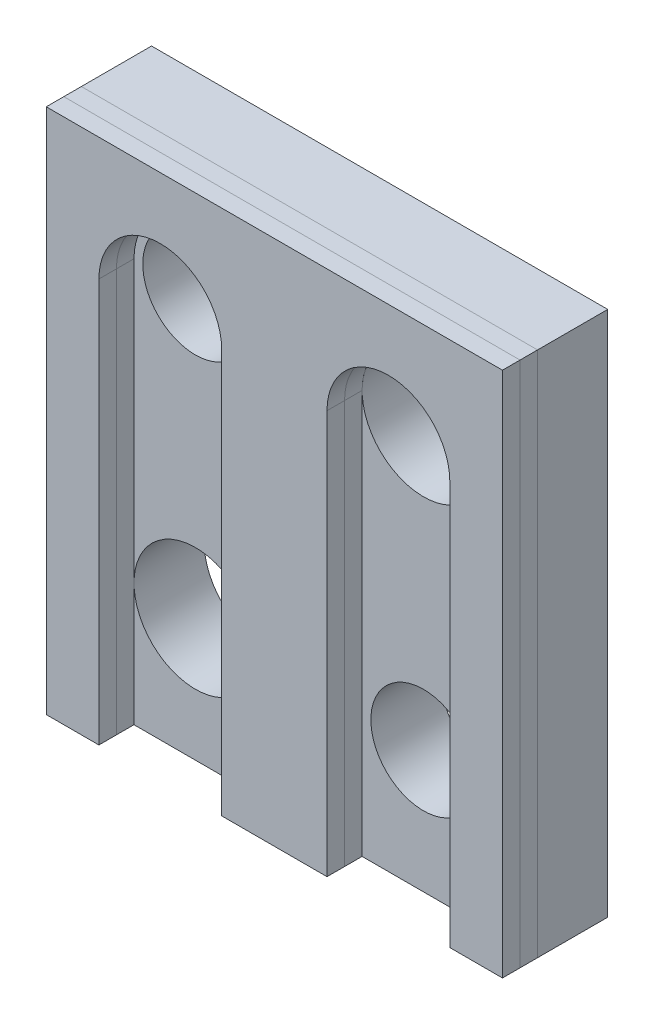
ISO-10303-21;
HEADER;
FILE_DESCRIPTION(('STEP AP214'),'2;1');
FILE_NAME('part.step','',(''),(''),'','','');
FILE_SCHEMA(('AUTOMOTIVE_DESIGN { 1 0 10303 214 1 1 1 1 }'));
ENDSEC;
DATA;
#1=APPLICATION_CONTEXT('core data for automotive mechanical design processes');
#2=APPLICATION_PROTOCOL_DEFINITION('international standard','automotive_design',2000,#1);
#3=PRODUCT_CONTEXT('',#1,'mechanical');
#4=PRODUCT('Part','Part','',(#3));
#5=PRODUCT_RELATED_PRODUCT_CATEGORY('part','',(#4));
#6=PRODUCT_DEFINITION_FORMATION('','',#4);
#7=PRODUCT_DEFINITION_CONTEXT('part definition',#1,'design');
#8=PRODUCT_DEFINITION('design','',#6,#7);
#9=PRODUCT_DEFINITION_SHAPE('','',#8);
#10=(LENGTH_UNIT() NAMED_UNIT(*) SI_UNIT(.MILLI.,.METRE.));
#11=(NAMED_UNIT(*) PLANE_ANGLE_UNIT() SI_UNIT($,.RADIAN.));
#12=(NAMED_UNIT(*) SI_UNIT($,.STERADIAN.) SOLID_ANGLE_UNIT());
#13=UNCERTAINTY_MEASURE_WITH_UNIT(LENGTH_MEASURE(1.E-05),#10,'distance_accuracy_value','');
#14=(GEOMETRIC_REPRESENTATION_CONTEXT(3) GLOBAL_UNCERTAINTY_ASSIGNED_CONTEXT((#13)) GLOBAL_UNIT_ASSIGNED_CONTEXT((#10,
#11,#12)) REPRESENTATION_CONTEXT('',''));
#15=CARTESIAN_POINT('',(0.,0.,0.));
#16=DIRECTION('',(0.,0.,1.));
#17=DIRECTION('',(1.,0.,0.));
#18=AXIS2_PLACEMENT_3D('',#15,#16,#17);
#19=CARTESIAN_POINT('',(-13.,-15.01,5.));
#20=DIRECTION('',(0.,0.,1.));
#21=DIRECTION('',(1.,0.,0.));
#22=AXIS2_PLACEMENT_3D('',#19,#20,#21);
#23=PLANE('',#22);
#24=DIRECTION('',(0.,-1.,0.));
#25=VECTOR('',#24,1.);
#26=CARTESIAN_POINT('',(10.,8.,5.));
#27=LINE('',#26,#25);
#28=CARTESIAN_POINT('',(10.,8.,5.));
#29=VERTEX_POINT('',#28);
#30=CARTESIAN_POINT('',(9.99999999999999,-15.,5.));
#31=VERTEX_POINT('',#30);
#32=EDGE_CURVE('E145',#29,#31,#27,.T.);
#33=ORIENTED_EDGE('',*,*,#32,.T.);
#34=DIRECTION('',(1.,0.,0.));
#35=VECTOR('',#34,1.);
#36=CARTESIAN_POINT('',(9.99999999999999,-15.,5.));
#37=LINE('',#36,#35);
#38=CARTESIAN_POINT('',(13.,-15.,5.));
#39=VERTEX_POINT('',#38);
#40=EDGE_CURVE('E152',#31,#39,#37,.T.);
#41=ORIENTED_EDGE('',*,*,#40,.T.);
#42=DIRECTION('',(0.,1.,0.));
#43=VECTOR('',#42,1.);
#44=CARTESIAN_POINT('',(13.,-15.,5.));
#45=LINE('',#44,#43);
#46=CARTESIAN_POINT('',(13.,15.,5.));
#47=VERTEX_POINT('',#46);
#48=EDGE_CURVE('E156',#39,#47,#45,.T.);
#49=ORIENTED_EDGE('',*,*,#48,.T.);
#50=DIRECTION('',(-1.,0.,0.));
#51=VECTOR('',#50,1.);
#52=CARTESIAN_POINT('',(13.,15.,5.));
#53=LINE('',#52,#51);
#54=CARTESIAN_POINT('',(-13.,15.,5.));
#55=VERTEX_POINT('',#54);
#56=EDGE_CURVE('E220',#47,#55,#53,.T.);
#57=ORIENTED_EDGE('',*,*,#56,.T.);
#58=DIRECTION('',(0.,-1.,0.));
#59=VECTOR('',#58,1.);
#60=CARTESIAN_POINT('',(-13.,15.,5.));
#61=LINE('',#60,#59);
#62=CARTESIAN_POINT('',(-13.,-15.,5.));
#63=VERTEX_POINT('',#62);
#64=EDGE_CURVE('E223',#55,#63,#61,.T.);
#65=ORIENTED_EDGE('',*,*,#64,.T.);
#66=DIRECTION('',(1.,0.,0.));
#67=VECTOR('',#66,1.);
#68=CARTESIAN_POINT('',(-13.,-15.,5.));
#69=LINE('',#68,#67);
#70=CARTESIAN_POINT('',(-9.99999999999999,-15.,5.));
#71=VERTEX_POINT('',#70);
#72=EDGE_CURVE('E226',#63,#71,#69,.T.);
#73=ORIENTED_EDGE('',*,*,#72,.T.);
#74=DIRECTION('',(0.,1.,0.));
#75=VECTOR('',#74,1.);
#76=CARTESIAN_POINT('',(-9.99999999999999,8.,5.));
#77=LINE('',#76,#75);
#78=CARTESIAN_POINT('',(-9.99999999999999,8.,5.));
#79=VERTEX_POINT('',#78);
#80=EDGE_CURVE('E229',#71,#79,#77,.T.);
#81=ORIENTED_EDGE('',*,*,#80,.T.);
#82=CARTESIAN_POINT('',(-6.5,8.,5.));
#83=DIRECTION('',(0.,0.,1.));
#84=DIRECTION('',(1.,0.,0.));
#85=AXIS2_PLACEMENT_3D('',#82,#83,#84);
#86=CIRCLE('',#85,3.5);
#87=CARTESIAN_POINT('',(-3.,8.,5.));
#88=VERTEX_POINT('',#87);
#89=EDGE_CURVE('E232',#79,#88,#86,.F.);
#90=ORIENTED_EDGE('',*,*,#89,.T.);
#91=DIRECTION('',(0.,-1.,0.));
#92=VECTOR('',#91,1.);
#93=CARTESIAN_POINT('',(-3.,8.,5.));
#94=LINE('',#93,#92);
#95=CARTESIAN_POINT('',(-3.,-15.,5.));
#96=VERTEX_POINT('',#95);
#97=EDGE_CURVE('E235',#88,#96,#94,.T.);
#98=ORIENTED_EDGE('',*,*,#97,.T.);
#99=DIRECTION('',(1.,0.,0.));
#100=VECTOR('',#99,1.);
#101=CARTESIAN_POINT('',(-3.,-15.,5.));
#102=LINE('',#101,#100);
#103=CARTESIAN_POINT('',(2.99999999999999,-15.,5.));
#104=VERTEX_POINT('',#103);
#105=EDGE_CURVE('E238',#96,#104,#102,.T.);
#106=ORIENTED_EDGE('',*,*,#105,.T.);
#107=DIRECTION('',(0.,1.,0.));
#108=VECTOR('',#107,1.);
#109=CARTESIAN_POINT('',(3.,8.,5.));
#110=LINE('',#109,#108);
#111=CARTESIAN_POINT('',(3.,8.,5.));
#112=VERTEX_POINT('',#111);
#113=EDGE_CURVE('E163',#104,#112,#110,.T.);
#114=ORIENTED_EDGE('',*,*,#113,.T.);
#115=CARTESIAN_POINT('',(6.5,8.,5.));
#116=DIRECTION('',(0.,0.,1.));
#117=DIRECTION('',(1.,0.,0.));
#118=AXIS2_PLACEMENT_3D('',#115,#116,#117);
#119=CIRCLE('',#118,3.5);
#120=EDGE_CURVE('E161',#112,#29,#119,.F.);
#121=ORIENTED_EDGE('',*,*,#120,.T.);
#122=EDGE_LOOP('',(#33,#41,#49,#57,#65,#73,#81,#90,#98,#106,#114,#121));
#123=FACE_BOUND('',#122,.T.);
#124=ADVANCED_FACE('F51',(#123),#23,.T.);
#125=CARTESIAN_POINT('',(9.99999999999999,-15.,6.));
#126=DIRECTION('',(0.,1.,0.));
#127=DIRECTION('',(-1.,0.,0.));
#128=AXIS2_PLACEMENT_3D('',#125,#126,#127);
#129=PLANE('',#128);
#130=ORIENTED_EDGE('',*,*,#40,.F.);
#131=DIRECTION('',(0.,0.,-1.));
#132=VECTOR('',#131,1.);
#133=CARTESIAN_POINT('',(9.99999999999999,-15.,6.));
#134=LINE('',#133,#132);
#135=CARTESIAN_POINT('',(9.99999999999999,-15.,4.));
#136=VERTEX_POINT('',#135);
#137=EDGE_CURVE('E55',#31,#136,#134,.T.);
#138=ORIENTED_EDGE('',*,*,#137,.T.);
#139=DIRECTION('',(1.,0.,0.));
#140=VECTOR('',#139,1.);
#141=CARTESIAN_POINT('',(9.99999999999999,-15.,4.));
#142=LINE('',#141,#140);
#143=CARTESIAN_POINT('',(13.,-15.,4.));
#144=VERTEX_POINT('',#143);
#145=EDGE_CURVE('E12',#136,#144,#142,.T.);
#146=ORIENTED_EDGE('',*,*,#145,.T.);
#147=DIRECTION('',(0.,0.,-1.));
#148=VECTOR('',#147,1.);
#149=CARTESIAN_POINT('',(13.,-15.,6.));
#150=LINE('',#149,#148);
#151=EDGE_CURVE('E68',#39,#144,#150,.T.);
#152=ORIENTED_EDGE('',*,*,#151,.F.);
#153=EDGE_LOOP('',(#130,#138,#146,#152));
#154=FACE_BOUND('',#153,.T.);
#155=ADVANCED_FACE('F153',(#154),#129,.F.);
#156=CARTESIAN_POINT('',(13.,-15.,6.));
#157=DIRECTION('',(-1.,0.,0.));
#158=DIRECTION('',(0.,0.,1.));
#159=AXIS2_PLACEMENT_3D('',#156,#157,#158);
#160=PLANE('',#159);
#161=ORIENTED_EDGE('',*,*,#48,.F.);
#162=ORIENTED_EDGE('',*,*,#151,.T.);
#163=DIRECTION('',(0.,1.,0.));
#164=VECTOR('',#163,1.);
#165=CARTESIAN_POINT('',(13.,-15.,4.));
#166=LINE('',#165,#164);
#167=CARTESIAN_POINT('',(13.,15.,4.));
#168=VERTEX_POINT('',#167);
#169=EDGE_CURVE('E60',#144,#168,#166,.T.);
#170=ORIENTED_EDGE('',*,*,#169,.T.);
#171=DIRECTION('',(0.,0.,-1.));
#172=VECTOR('',#171,1.);
#173=CARTESIAN_POINT('',(13.,15.,6.));
#174=LINE('',#173,#172);
#175=EDGE_CURVE('E76',#47,#168,#174,.T.);
#176=ORIENTED_EDGE('',*,*,#175,.F.);
#177=EDGE_LOOP('',(#161,#162,#170,#176));
#178=FACE_BOUND('',#177,.T.);
#179=ADVANCED_FACE('F269',(#178),#160,.F.);
#180=CARTESIAN_POINT('',(13.,15.,6.));
#181=DIRECTION('',(0.,-1.,0.));
#182=DIRECTION('',(0.,0.,-1.));
#183=AXIS2_PLACEMENT_3D('',#180,#181,#182);
#184=PLANE('',#183);
#185=ORIENTED_EDGE('',*,*,#56,.F.);
#186=ORIENTED_EDGE('',*,*,#175,.T.);
#187=DIRECTION('',(-1.,0.,0.));
#188=VECTOR('',#187,1.);
#189=CARTESIAN_POINT('',(13.,15.,4.));
#190=LINE('',#189,#188);
#191=CARTESIAN_POINT('',(-13.,15.,4.));
#192=VERTEX_POINT('',#191);
#193=EDGE_CURVE('E216',#168,#192,#190,.T.);
#194=ORIENTED_EDGE('',*,*,#193,.T.);
#195=DIRECTION('',(0.,0.,-1.));
#196=VECTOR('',#195,1.);
#197=CARTESIAN_POINT('',(-13.,15.,6.));
#198=LINE('',#197,#196);
#199=EDGE_CURVE('E169',#55,#192,#198,.T.);
#200=ORIENTED_EDGE('',*,*,#199,.F.);
#201=EDGE_LOOP('',(#185,#186,#194,#200));
#202=FACE_BOUND('',#201,.T.);
#203=ADVANCED_FACE('F268',(#202),#184,.F.);
#204=CARTESIAN_POINT('',(-13.,15.,6.));
#205=DIRECTION('',(1.,0.,0.));
#206=DIRECTION('',(0.,0.,-1.));
#207=AXIS2_PLACEMENT_3D('',#204,#205,#206);
#208=PLANE('',#207);
#209=ORIENTED_EDGE('',*,*,#64,.F.);
#210=ORIENTED_EDGE('',*,*,#199,.T.);
#211=DIRECTION('',(0.,-1.,0.));
#212=VECTOR('',#211,1.);
#213=CARTESIAN_POINT('',(-13.,15.,4.));
#214=LINE('',#213,#212);
#215=CARTESIAN_POINT('',(-13.,-15.,4.));
#216=VERTEX_POINT('',#215);
#217=EDGE_CURVE('E213',#192,#216,#214,.T.);
#218=ORIENTED_EDGE('',*,*,#217,.T.);
#219=DIRECTION('',(0.,0.,-1.));
#220=VECTOR('',#219,1.);
#221=CARTESIAN_POINT('',(-13.,-15.,6.));
#222=LINE('',#221,#220);
#223=EDGE_CURVE('E171',#63,#216,#222,.T.);
#224=ORIENTED_EDGE('',*,*,#223,.F.);
#225=EDGE_LOOP('',(#209,#210,#218,#224));
#226=FACE_BOUND('',#225,.T.);
#227=ADVANCED_FACE('F266',(#226),#208,.F.);
#228=CARTESIAN_POINT('',(-13.,-15.,6.));
#229=DIRECTION('',(0.,1.,0.));
#230=DIRECTION('',(-1.,0.,0.));
#231=AXIS2_PLACEMENT_3D('',#228,#229,#230);
#232=PLANE('',#231);
#233=ORIENTED_EDGE('',*,*,#72,.F.);
#234=ORIENTED_EDGE('',*,*,#223,.T.);
#235=DIRECTION('',(1.,0.,0.));
#236=VECTOR('',#235,1.);
#237=CARTESIAN_POINT('',(-13.,-15.,4.));
#238=LINE('',#237,#236);
#239=CARTESIAN_POINT('',(-9.99999999999999,-15.,4.));
#240=VERTEX_POINT('',#239);
#241=EDGE_CURVE('E210',#216,#240,#238,.T.);
#242=ORIENTED_EDGE('',*,*,#241,.T.);
#243=DIRECTION('',(0.,0.,-1.));
#244=VECTOR('',#243,1.);
#245=CARTESIAN_POINT('',(-9.99999999999999,-15.,6.));
#246=LINE('',#245,#244);
#247=EDGE_CURVE('E173',#71,#240,#246,.T.);
#248=ORIENTED_EDGE('',*,*,#247,.F.);
#249=EDGE_LOOP('',(#233,#234,#242,#248));
#250=FACE_BOUND('',#249,.T.);
#251=ADVANCED_FACE('F263',(#250),#232,.F.);
#252=CARTESIAN_POINT('',(-9.99999999999999,8.,6.));
#253=DIRECTION('',(-1.,0.,0.));
#254=DIRECTION('',(0.,0.,1.));
#255=AXIS2_PLACEMENT_3D('',#252,#253,#254);
#256=PLANE('',#255);
#257=ORIENTED_EDGE('',*,*,#80,.F.);
#258=ORIENTED_EDGE('',*,*,#247,.T.);
#259=DIRECTION('',(0.,1.,0.));
#260=VECTOR('',#259,1.);
#261=CARTESIAN_POINT('',(-9.99999999999999,8.,4.));
#262=LINE('',#261,#260);
#263=CARTESIAN_POINT('',(-9.99999999999999,8.,4.));
#264=VERTEX_POINT('',#263);
#265=EDGE_CURVE('E207',#240,#264,#262,.T.);
#266=ORIENTED_EDGE('',*,*,#265,.T.);
#267=DIRECTION('',(0.,0.,-1.));
#268=VECTOR('',#267,1.);
#269=CARTESIAN_POINT('',(-9.99999999999999,8.,6.));
#270=LINE('',#269,#268);
#271=EDGE_CURVE('E175',#79,#264,#270,.T.);
#272=ORIENTED_EDGE('',*,*,#271,.F.);
#273=EDGE_LOOP('',(#257,#258,#266,#272));
#274=FACE_BOUND('',#273,.T.);
#275=ADVANCED_FACE('F260',(#274),#256,.F.);
#276=CARTESIAN_POINT('',(-6.5,8.,6.));
#277=DIRECTION('',(0.,0.,-1.));
#278=DIRECTION('',(-1.,0.,0.));
#279=AXIS2_PLACEMENT_3D('',#276,#277,#278);
#280=CYLINDRICAL_SURFACE('',#279,3.5);
#281=ORIENTED_EDGE('',*,*,#89,.F.);
#282=ORIENTED_EDGE('',*,*,#271,.T.);
#283=CARTESIAN_POINT('',(-6.5,8.,4.));
#284=DIRECTION('',(0.,0.,-1.));
#285=DIRECTION('',(1.,0.,0.));
#286=AXIS2_PLACEMENT_3D('',#283,#284,#285);
#287=CIRCLE('',#286,3.5);
#288=CARTESIAN_POINT('',(-3.,8.,4.));
#289=VERTEX_POINT('',#288);
#290=EDGE_CURVE('E204',#264,#289,#287,.T.);
#291=ORIENTED_EDGE('',*,*,#290,.T.);
#292=DIRECTION('',(0.,0.,-1.));
#293=VECTOR('',#292,1.);
#294=CARTESIAN_POINT('',(-3.,8.,6.));
#295=LINE('',#294,#293);
#296=EDGE_CURVE('E177',#88,#289,#295,.T.);
#297=ORIENTED_EDGE('',*,*,#296,.F.);
#298=EDGE_LOOP('',(#281,#282,#291,#297));
#299=FACE_BOUND('',#298,.T.);
#300=ADVANCED_FACE('F254',(#299),#280,.F.);
#301=CARTESIAN_POINT('',(-3.,8.,6.));
#302=DIRECTION('',(1.,0.,0.));
#303=DIRECTION('',(0.,1.,0.));
#304=AXIS2_PLACEMENT_3D('',#301,#302,#303);
#305=PLANE('',#304);
#306=ORIENTED_EDGE('',*,*,#97,.F.);
#307=ORIENTED_EDGE('',*,*,#296,.T.);
#308=DIRECTION('',(0.,-1.,0.));
#309=VECTOR('',#308,1.);
#310=CARTESIAN_POINT('',(-3.,8.,4.));
#311=LINE('',#310,#309);
#312=CARTESIAN_POINT('',(-3.,-15.,4.));
#313=VERTEX_POINT('',#312);
#314=EDGE_CURVE('E201',#289,#313,#311,.T.);
#315=ORIENTED_EDGE('',*,*,#314,.T.);
#316=DIRECTION('',(0.,0.,-1.));
#317=VECTOR('',#316,1.);
#318=CARTESIAN_POINT('',(-3.,-15.,6.));
#319=LINE('',#318,#317);
#320=EDGE_CURVE('E179',#96,#313,#319,.T.);
#321=ORIENTED_EDGE('',*,*,#320,.F.);
#322=EDGE_LOOP('',(#306,#307,#315,#321));
#323=FACE_BOUND('',#322,.T.);
#324=ADVANCED_FACE('F251',(#323),#305,.F.);
#325=CARTESIAN_POINT('',(-3.,-15.,6.));
#326=DIRECTION('',(0.,1.,0.));
#327=DIRECTION('',(0.,0.,1.));
#328=AXIS2_PLACEMENT_3D('',#325,#326,#327);
#329=PLANE('',#328);
#330=ORIENTED_EDGE('',*,*,#105,.F.);
#331=ORIENTED_EDGE('',*,*,#320,.T.);
#332=DIRECTION('',(1.,0.,0.));
#333=VECTOR('',#332,1.);
#334=CARTESIAN_POINT('',(-3.,-15.,4.));
#335=LINE('',#334,#333);
#336=CARTESIAN_POINT('',(2.99999999999999,-15.,4.));
#337=VERTEX_POINT('',#336);
#338=EDGE_CURVE('E198',#313,#337,#335,.T.);
#339=ORIENTED_EDGE('',*,*,#338,.T.);
#340=DIRECTION('',(0.,0.,-1.));
#341=VECTOR('',#340,1.);
#342=CARTESIAN_POINT('',(2.99999999999999,-15.,6.));
#343=LINE('',#342,#341);
#344=EDGE_CURVE('E181',#104,#337,#343,.T.);
#345=ORIENTED_EDGE('',*,*,#344,.F.);
#346=EDGE_LOOP('',(#330,#331,#339,#345));
#347=FACE_BOUND('',#346,.T.);
#348=ADVANCED_FACE('F248',(#347),#329,.F.);
#349=CARTESIAN_POINT('',(3.,8.,6.));
#350=DIRECTION('',(-1.,0.,0.));
#351=DIRECTION('',(0.,-1.,0.));
#352=AXIS2_PLACEMENT_3D('',#349,#350,#351);
#353=PLANE('',#352);
#354=ORIENTED_EDGE('',*,*,#113,.F.);
#355=ORIENTED_EDGE('',*,*,#344,.T.);
#356=DIRECTION('',(0.,1.,0.));
#357=VECTOR('',#356,1.);
#358=CARTESIAN_POINT('',(3.,8.,4.));
#359=LINE('',#358,#357);
#360=CARTESIAN_POINT('',(3.,8.,4.));
#361=VERTEX_POINT('',#360);
#362=EDGE_CURVE('E192',#337,#361,#359,.T.);
#363=ORIENTED_EDGE('',*,*,#362,.T.);
#364=DIRECTION('',(0.,0.,-1.));
#365=VECTOR('',#364,1.);
#366=CARTESIAN_POINT('',(3.,8.,6.));
#367=LINE('',#366,#365);
#368=EDGE_CURVE('E183',#112,#361,#367,.T.);
#369=ORIENTED_EDGE('',*,*,#368,.F.);
#370=EDGE_LOOP('',(#354,#355,#363,#369));
#371=FACE_BOUND('',#370,.T.);
#372=ADVANCED_FACE('F243',(#371),#353,.F.);
#373=CARTESIAN_POINT('',(6.5,8.,6.));
#374=DIRECTION('',(0.,0.,-1.));
#375=DIRECTION('',(-1.,0.,0.));
#376=AXIS2_PLACEMENT_3D('',#373,#374,#375);
#377=CYLINDRICAL_SURFACE('',#376,3.5);
#378=ORIENTED_EDGE('',*,*,#120,.F.);
#379=ORIENTED_EDGE('',*,*,#368,.T.);
#380=CARTESIAN_POINT('',(6.5,8.,4.));
#381=DIRECTION('',(0.,0.,-1.));
#382=DIRECTION('',(1.,0.,0.));
#383=AXIS2_PLACEMENT_3D('',#380,#381,#382);
#384=CIRCLE('',#383,3.5);
#385=CARTESIAN_POINT('',(10.,8.,4.));
#386=VERTEX_POINT('',#385);
#387=EDGE_CURVE('E187',#361,#386,#384,.T.);
#388=ORIENTED_EDGE('',*,*,#387,.T.);
#389=DIRECTION('',(0.,0.,-1.));
#390=VECTOR('',#389,1.);
#391=CARTESIAN_POINT('',(10.,8.,6.));
#392=LINE('',#391,#390);
#393=EDGE_CURVE('E150',#29,#386,#392,.T.);
#394=ORIENTED_EDGE('',*,*,#393,.F.);
#395=EDGE_LOOP('',(#378,#379,#388,#394));
#396=FACE_BOUND('',#395,.T.);
#397=ADVANCED_FACE('F188',(#396),#377,.F.);
#398=CARTESIAN_POINT('',(10.,8.,6.));
#399=DIRECTION('',(1.,0.,0.));
#400=DIRECTION('',(0.,1.,0.));
#401=AXIS2_PLACEMENT_3D('',#398,#399,#400);
#402=PLANE('',#401);
#403=ORIENTED_EDGE('',*,*,#32,.F.);
#404=ORIENTED_EDGE('',*,*,#393,.T.);
#405=DIRECTION('',(0.,-1.,0.));
#406=VECTOR('',#405,1.);
#407=CARTESIAN_POINT('',(10.,8.,4.));
#408=LINE('',#407,#406);
#409=EDGE_CURVE('E147',#386,#136,#408,.T.);
#410=ORIENTED_EDGE('',*,*,#409,.T.);
#411=ORIENTED_EDGE('',*,*,#137,.F.);
#412=EDGE_LOOP('',(#403,#404,#410,#411));
#413=FACE_BOUND('',#412,.T.);
#414=ADVANCED_FACE('F53',(#413),#402,.F.);
#415=CARTESIAN_POINT('',(-6.5,8.,4.));
#416=DIRECTION('',(0.,0.,1.));
#417=DIRECTION('',(1.,0.,0.));
#418=AXIS2_PLACEMENT_3D('',#415,#416,#417);
#419=PLANE('',#418);
#420=ORIENTED_EDGE('',*,*,#145,.F.);
#421=ORIENTED_EDGE('',*,*,#409,.F.);
#422=ORIENTED_EDGE('',*,*,#387,.F.);
#423=ORIENTED_EDGE('',*,*,#362,.F.);
#424=ORIENTED_EDGE('',*,*,#338,.F.);
#425=ORIENTED_EDGE('',*,*,#314,.F.);
#426=ORIENTED_EDGE('',*,*,#290,.F.);
#427=ORIENTED_EDGE('',*,*,#265,.F.);
#428=ORIENTED_EDGE('',*,*,#241,.F.);
#429=ORIENTED_EDGE('',*,*,#217,.F.);
#430=ORIENTED_EDGE('',*,*,#193,.F.);
#431=ORIENTED_EDGE('',*,*,#169,.F.);
#432=EDGE_LOOP('',(#420,#421,#422,#423,#424,#425,#426,#427,#428,#429,#430,#431));
#433=FACE_BOUND('',#432,.T.);
#434=ADVANCED_FACE('F194',(#433),#419,.F.);
#435=CLOSED_SHELL('',(#124,#155,#179,#203,#227,#251,#275,#300,#324,#348,#372,#397,#414,#434));
#436=MANIFOLD_SOLID_BREP('B2',#435);
#437=CARTESIAN_POINT('',(-13.,-15.01,5.));
#438=DIRECTION('',(0.,0.,1.));
#439=DIRECTION('',(1.,0.,0.));
#440=AXIS2_PLACEMENT_3D('',#437,#438,#439);
#441=PLANE('',#440);
#442=DIRECTION('',(0.,-1.,0.));
#443=VECTOR('',#442,1.);
#444=CARTESIAN_POINT('',(10.,8.,5.));
#445=LINE('',#444,#443);
#446=CARTESIAN_POINT('',(10.,8.,5.));
#447=VERTEX_POINT('',#446);
#448=CARTESIAN_POINT('',(9.99999999999999,-15.,5.));
#449=VERTEX_POINT('',#448);
#450=EDGE_CURVE('E496',#447,#449,#445,.T.);
#451=ORIENTED_EDGE('',*,*,#450,.F.);
#452=CARTESIAN_POINT('',(6.5,8.,5.));
#453=DIRECTION('',(0.,0.,1.));
#454=DIRECTION('',(1.,0.,0.));
#455=AXIS2_PLACEMENT_3D('',#452,#453,#454);
#456=CIRCLE('',#455,3.5);
#457=CARTESIAN_POINT('',(3.,8.,5.));
#458=VERTEX_POINT('',#457);
#459=EDGE_CURVE('E499',#458,#447,#456,.F.);
#460=ORIENTED_EDGE('',*,*,#459,.F.);
#461=DIRECTION('',(0.,1.,0.));
#462=VECTOR('',#461,1.);
#463=CARTESIAN_POINT('',(3.,8.,5.));
#464=LINE('',#463,#462);
#465=CARTESIAN_POINT('',(2.99999999999999,-15.,5.));
#466=VERTEX_POINT('',#465);
#467=EDGE_CURVE('E512',#466,#458,#464,.T.);
#468=ORIENTED_EDGE('',*,*,#467,.F.);
#469=DIRECTION('',(1.,0.,0.));
#470=VECTOR('',#469,1.);
#471=CARTESIAN_POINT('',(-3.,-15.,5.));
#472=LINE('',#471,#470);
#473=CARTESIAN_POINT('',(-3.,-15.,5.));
#474=VERTEX_POINT('',#473);
#475=EDGE_CURVE('E514',#474,#466,#472,.T.);
#476=ORIENTED_EDGE('',*,*,#475,.F.);
#477=DIRECTION('',(0.,-1.,0.));
#478=VECTOR('',#477,1.);
#479=CARTESIAN_POINT('',(-3.,8.,5.));
#480=LINE('',#479,#478);
#481=CARTESIAN_POINT('',(-3.,8.,5.));
#482=VERTEX_POINT('',#481);
#483=EDGE_CURVE('E516',#482,#474,#480,.T.);
#484=ORIENTED_EDGE('',*,*,#483,.F.);
#485=CARTESIAN_POINT('',(-6.5,8.,5.));
#486=DIRECTION('',(0.,0.,1.));
#487=DIRECTION('',(1.,0.,0.));
#488=AXIS2_PLACEMENT_3D('',#485,#486,#487);
#489=CIRCLE('',#488,3.5);
#490=CARTESIAN_POINT('',(-9.99999999999999,8.,5.));
#491=VERTEX_POINT('',#490);
#492=EDGE_CURVE('E518',#491,#482,#489,.F.);
#493=ORIENTED_EDGE('',*,*,#492,.F.);
#494=DIRECTION('',(0.,1.,0.));
#495=VECTOR('',#494,1.);
#496=CARTESIAN_POINT('',(-9.99999999999999,8.,5.));
#497=LINE('',#496,#495);
#498=CARTESIAN_POINT('',(-9.99999999999999,-15.,5.));
#499=VERTEX_POINT('',#498);
#500=EDGE_CURVE('E520',#499,#491,#497,.T.);
#501=ORIENTED_EDGE('',*,*,#500,.F.);
#502=DIRECTION('',(1.,0.,0.));
#503=VECTOR('',#502,1.);
#504=CARTESIAN_POINT('',(-13.,-15.,5.));
#505=LINE('',#504,#503);
#506=CARTESIAN_POINT('',(-13.,-15.,5.));
#507=VERTEX_POINT('',#506);
#508=EDGE_CURVE('E508',#507,#499,#505,.T.);
#509=ORIENTED_EDGE('',*,*,#508,.F.);
#510=DIRECTION('',(0.,-1.,0.));
#511=VECTOR('',#510,1.);
#512=CARTESIAN_POINT('',(-13.,15.,5.));
#513=LINE('',#512,#511);
#514=CARTESIAN_POINT('',(-13.,15.,5.));
#515=VERTEX_POINT('',#514);
#516=EDGE_CURVE('E505',#515,#507,#513,.T.);
#517=ORIENTED_EDGE('',*,*,#516,.F.);
#518=DIRECTION('',(-1.,0.,0.));
#519=VECTOR('',#518,1.);
#520=CARTESIAN_POINT('',(13.,15.,5.));
#521=LINE('',#520,#519);
#522=CARTESIAN_POINT('',(13.,15.,5.));
#523=VERTEX_POINT('',#522);
#524=EDGE_CURVE('E507',#523,#515,#521,.T.);
#525=ORIENTED_EDGE('',*,*,#524,.F.);
#526=DIRECTION('',(0.,1.,0.));
#527=VECTOR('',#526,1.);
#528=CARTESIAN_POINT('',(13.,-15.,5.));
#529=LINE('',#528,#527);
#530=CARTESIAN_POINT('',(13.,-15.,5.));
#531=VERTEX_POINT('',#530);
#532=EDGE_CURVE('E401',#531,#523,#529,.T.);
#533=ORIENTED_EDGE('',*,*,#532,.F.);
#534=DIRECTION('',(1.,0.,0.));
#535=VECTOR('',#534,1.);
#536=CARTESIAN_POINT('',(9.99999999999999,-15.,5.));
#537=LINE('',#536,#535);
#538=EDGE_CURVE('E49',#449,#531,#537,.T.);
#539=ORIENTED_EDGE('',*,*,#538,.F.);
#540=EDGE_LOOP('',(#451,#460,#468,#476,#484,#493,#501,#509,#517,#525,#533,#539));
#541=FACE_BOUND('',#540,.T.);
#542=ADVANCED_FACE('F394',(#541),#441,.F.);
#543=CARTESIAN_POINT('',(13.,-15.,6.));
#544=DIRECTION('',(-1.,0.,0.));
#545=DIRECTION('',(0.,0.,1.));
#546=AXIS2_PLACEMENT_3D('',#543,#544,#545);
#547=PLANE('',#546);
#548=DIRECTION('',(0.,0.,-1.));
#549=VECTOR('',#548,1.);
#550=CARTESIAN_POINT('',(13.,-15.,6.));
#551=LINE('',#550,#549);
#552=CARTESIAN_POINT('',(13.,-15.,6.));
#553=VERTEX_POINT('',#552);
#554=EDGE_CURVE('E481',#553,#531,#551,.T.);
#555=ORIENTED_EDGE('',*,*,#554,.T.);
#556=ORIENTED_EDGE('',*,*,#532,.T.);
#557=DIRECTION('',(0.,0.,-1.));
#558=VECTOR('',#557,1.);
#559=CARTESIAN_POINT('',(13.,15.,6.));
#560=LINE('',#559,#558);
#561=CARTESIAN_POINT('',(13.,15.,6.));
#562=VERTEX_POINT('',#561);
#563=EDGE_CURVE('E483',#562,#523,#560,.T.);
#564=ORIENTED_EDGE('',*,*,#563,.F.);
#565=DIRECTION('',(0.,1.,0.));
#566=VECTOR('',#565,1.);
#567=CARTESIAN_POINT('',(13.,-15.,6.));
#568=LINE('',#567,#566);
#569=EDGE_CURVE('E478',#553,#562,#568,.T.);
#570=ORIENTED_EDGE('',*,*,#569,.F.);
#571=EDGE_LOOP('',(#555,#556,#564,#570));
#572=FACE_BOUND('',#571,.T.);
#573=ADVANCED_FACE('F480',(#572),#547,.F.);
#574=CARTESIAN_POINT('',(13.,15.,6.));
#575=DIRECTION('',(0.,-1.,0.));
#576=DIRECTION('',(0.,0.,-1.));
#577=AXIS2_PLACEMENT_3D('',#574,#575,#576);
#578=PLANE('',#577);
#579=ORIENTED_EDGE('',*,*,#563,.T.);
#580=ORIENTED_EDGE('',*,*,#524,.T.);
#581=DIRECTION('',(0.,0.,-1.));
#582=VECTOR('',#581,1.);
#583=CARTESIAN_POINT('',(-13.,15.,6.));
#584=LINE('',#583,#582);
#585=CARTESIAN_POINT('',(-13.,15.,6.));
#586=VERTEX_POINT('',#585);
#587=EDGE_CURVE('E501',#586,#515,#584,.T.);
#588=ORIENTED_EDGE('',*,*,#587,.F.);
#589=DIRECTION('',(-1.,0.,0.));
#590=VECTOR('',#589,1.);
#591=CARTESIAN_POINT('',(13.,15.,6.));
#592=LINE('',#591,#590);
#593=EDGE_CURVE('E486',#562,#586,#592,.T.);
#594=ORIENTED_EDGE('',*,*,#593,.F.);
#595=EDGE_LOOP('',(#579,#580,#588,#594));
#596=FACE_BOUND('',#595,.T.);
#597=ADVANCED_FACE('F556',(#596),#578,.F.);
#598=CARTESIAN_POINT('',(-13.,15.,6.));
#599=DIRECTION('',(1.,0.,0.));
#600=DIRECTION('',(0.,0.,-1.));
#601=AXIS2_PLACEMENT_3D('',#598,#599,#600);
#602=PLANE('',#601);
#603=ORIENTED_EDGE('',*,*,#587,.T.);
#604=ORIENTED_EDGE('',*,*,#516,.T.);
#605=DIRECTION('',(0.,0.,-1.));
#606=VECTOR('',#605,1.);
#607=CARTESIAN_POINT('',(-13.,-15.,6.));
#608=LINE('',#607,#606);
#609=CARTESIAN_POINT('',(-13.,-15.,6.));
#610=VERTEX_POINT('',#609);
#611=EDGE_CURVE('E532',#610,#507,#608,.T.);
#612=ORIENTED_EDGE('',*,*,#611,.F.);
#613=DIRECTION('',(0.,-1.,0.));
#614=VECTOR('',#613,1.);
#615=CARTESIAN_POINT('',(-13.,15.,6.));
#616=LINE('',#615,#614);
#617=EDGE_CURVE('E554',#586,#610,#616,.T.);
#618=ORIENTED_EDGE('',*,*,#617,.F.);
#619=EDGE_LOOP('',(#603,#604,#612,#618));
#620=FACE_BOUND('',#619,.T.);
#621=ADVANCED_FACE('F553',(#620),#602,.F.);
#622=CARTESIAN_POINT('',(-13.,-15.,6.));
#623=DIRECTION('',(0.,1.,0.));
#624=DIRECTION('',(-1.,0.,0.));
#625=AXIS2_PLACEMENT_3D('',#622,#623,#624);
#626=PLANE('',#625);
#627=ORIENTED_EDGE('',*,*,#611,.T.);
#628=ORIENTED_EDGE('',*,*,#508,.T.);
#629=DIRECTION('',(0.,0.,-1.));
#630=VECTOR('',#629,1.);
#631=CARTESIAN_POINT('',(-9.99999999999999,-15.,6.));
#632=LINE('',#631,#630);
#633=CARTESIAN_POINT('',(-9.99999999999999,-15.,6.));
#634=VERTEX_POINT('',#633);
#635=EDGE_CURVE('E529',#634,#499,#632,.T.);
#636=ORIENTED_EDGE('',*,*,#635,.F.);
#637=DIRECTION('',(1.,0.,0.));
#638=VECTOR('',#637,1.);
#639=CARTESIAN_POINT('',(-13.,-15.,6.));
#640=LINE('',#639,#638);
#641=EDGE_CURVE('E721',#610,#634,#640,.T.);
#642=ORIENTED_EDGE('',*,*,#641,.F.);
#643=EDGE_LOOP('',(#627,#628,#636,#642));
#644=FACE_BOUND('',#643,.T.);
#645=ADVANCED_FACE('F526',(#644),#626,.F.);
#646=CARTESIAN_POINT('',(-9.99999999999999,8.,6.));
#647=DIRECTION('',(-1.,0.,0.));
#648=DIRECTION('',(0.,0.,1.));
#649=AXIS2_PLACEMENT_3D('',#646,#647,#648);
#650=PLANE('',#649);
#651=ORIENTED_EDGE('',*,*,#635,.T.);
#652=ORIENTED_EDGE('',*,*,#500,.T.);
#653=DIRECTION('',(0.,0.,-1.));
#654=VECTOR('',#653,1.);
#655=CARTESIAN_POINT('',(-9.99999999999999,8.,6.));
#656=LINE('',#655,#654);
#657=CARTESIAN_POINT('',(-9.99999999999999,8.,6.));
#658=VERTEX_POINT('',#657);
#659=EDGE_CURVE('E543',#658,#491,#656,.T.);
#660=ORIENTED_EDGE('',*,*,#659,.F.);
#661=DIRECTION('',(0.,1.,0.));
#662=VECTOR('',#661,1.);
#663=CARTESIAN_POINT('',(-9.99999999999999,8.,6.));
#664=LINE('',#663,#662);
#665=EDGE_CURVE('E542',#634,#658,#664,.T.);
#666=ORIENTED_EDGE('',*,*,#665,.F.);
#667=EDGE_LOOP('',(#651,#652,#660,#666));
#668=FACE_BOUND('',#667,.T.);
#669=ADVANCED_FACE('F541',(#668),#650,.F.);
#670=CARTESIAN_POINT('',(-6.5,8.,6.));
#671=DIRECTION('',(0.,0.,-1.));
#672=DIRECTION('',(-1.,0.,0.));
#673=AXIS2_PLACEMENT_3D('',#670,#671,#672);
#674=CYLINDRICAL_SURFACE('',#673,3.5);
#675=ORIENTED_EDGE('',*,*,#659,.T.);
#676=ORIENTED_EDGE('',*,*,#492,.T.);
#677=DIRECTION('',(0.,0.,-1.));
#678=VECTOR('',#677,1.);
#679=CARTESIAN_POINT('',(-3.,8.,6.));
#680=LINE('',#679,#678);
#681=CARTESIAN_POINT('',(-3.,8.,6.));
#682=VERTEX_POINT('',#681);
#683=EDGE_CURVE('E546',#682,#482,#680,.T.);
#684=ORIENTED_EDGE('',*,*,#683,.F.);
#685=CARTESIAN_POINT('',(-6.5,8.,6.));
#686=DIRECTION('',(0.,0.,-1.));
#687=DIRECTION('',(1.,0.,0.));
#688=AXIS2_PLACEMENT_3D('',#685,#686,#687);
#689=CIRCLE('',#688,3.5);
#690=EDGE_CURVE('E589',#658,#682,#689,.T.);
#691=ORIENTED_EDGE('',*,*,#690,.F.);
#692=EDGE_LOOP('',(#675,#676,#684,#691));
#693=FACE_BOUND('',#692,.T.);
#694=ADVANCED_FACE('F588',(#693),#674,.F.);
#695=CARTESIAN_POINT('',(-3.,8.,6.));
#696=DIRECTION('',(1.,0.,0.));
#697=DIRECTION('',(0.,1.,0.));
#698=AXIS2_PLACEMENT_3D('',#695,#696,#697);
#699=PLANE('',#698);
#700=ORIENTED_EDGE('',*,*,#683,.T.);
#701=ORIENTED_EDGE('',*,*,#483,.T.);
#702=DIRECTION('',(0.,0.,-1.));
#703=VECTOR('',#702,1.);
#704=CARTESIAN_POINT('',(-3.,-15.,6.));
#705=LINE('',#704,#703);
#706=CARTESIAN_POINT('',(-3.,-15.,6.));
#707=VERTEX_POINT('',#706);
#708=EDGE_CURVE('E576',#707,#474,#705,.T.);
#709=ORIENTED_EDGE('',*,*,#708,.F.);
#710=DIRECTION('',(0.,-1.,0.));
#711=VECTOR('',#710,1.);
#712=CARTESIAN_POINT('',(-3.,8.,6.));
#713=LINE('',#712,#711);
#714=EDGE_CURVE('E585',#682,#707,#713,.T.);
#715=ORIENTED_EDGE('',*,*,#714,.F.);
#716=EDGE_LOOP('',(#700,#701,#709,#715));
#717=FACE_BOUND('',#716,.T.);
#718=ADVANCED_FACE('F582',(#717),#699,.F.);
#719=CARTESIAN_POINT('',(-3.,-15.,6.));
#720=DIRECTION('',(0.,1.,0.));
#721=DIRECTION('',(0.,0.,1.));
#722=AXIS2_PLACEMENT_3D('',#719,#720,#721);
#723=PLANE('',#722);
#724=ORIENTED_EDGE('',*,*,#708,.T.);
#725=ORIENTED_EDGE('',*,*,#475,.T.);
#726=DIRECTION('',(0.,0.,-1.));
#727=VECTOR('',#726,1.);
#728=CARTESIAN_POINT('',(2.99999999999999,-15.,6.));
#729=LINE('',#728,#727);
#730=CARTESIAN_POINT('',(2.99999999999999,-15.,6.));
#731=VERTEX_POINT('',#730);
#732=EDGE_CURVE('E573',#731,#466,#729,.T.);
#733=ORIENTED_EDGE('',*,*,#732,.F.);
#734=DIRECTION('',(1.,0.,0.));
#735=VECTOR('',#734,1.);
#736=CARTESIAN_POINT('',(-3.,-15.,6.));
#737=LINE('',#736,#735);
#738=EDGE_CURVE('E595',#707,#731,#737,.T.);
#739=ORIENTED_EDGE('',*,*,#738,.F.);
#740=EDGE_LOOP('',(#724,#725,#733,#739));
#741=FACE_BOUND('',#740,.T.);
#742=ADVANCED_FACE('F594',(#741),#723,.F.);
#743=CARTESIAN_POINT('',(3.,8.,6.));
#744=DIRECTION('',(-1.,0.,0.));
#745=DIRECTION('',(0.,-1.,0.));
#746=AXIS2_PLACEMENT_3D('',#743,#744,#745);
#747=PLANE('',#746);
#748=ORIENTED_EDGE('',*,*,#732,.T.);
#749=ORIENTED_EDGE('',*,*,#467,.T.);
#750=DIRECTION('',(0.,0.,-1.));
#751=VECTOR('',#750,1.);
#752=CARTESIAN_POINT('',(3.,8.,6.));
#753=LINE('',#752,#751);
#754=CARTESIAN_POINT('',(3.,8.,6.));
#755=VERTEX_POINT('',#754);
#756=EDGE_CURVE('E565',#755,#458,#753,.T.);
#757=ORIENTED_EDGE('',*,*,#756,.F.);
#758=DIRECTION('',(0.,1.,0.));
#759=VECTOR('',#758,1.);
#760=CARTESIAN_POINT('',(3.,8.,6.));
#761=LINE('',#760,#759);
#762=EDGE_CURVE('E597',#731,#755,#761,.T.);
#763=ORIENTED_EDGE('',*,*,#762,.F.);
#764=EDGE_LOOP('',(#748,#749,#757,#763));
#765=FACE_BOUND('',#764,.T.);
#766=ADVANCED_FACE('F607',(#765),#747,.F.);
#767=CARTESIAN_POINT('',(-6.5,8.,6.));
#768=DIRECTION('',(0.,0.,1.));
#769=DIRECTION('',(1.,0.,0.));
#770=AXIS2_PLACEMENT_3D('',#767,#768,#769);
#771=PLANE('',#770);
#772=DIRECTION('',(1.,0.,0.));
#773=VECTOR('',#772,1.);
#774=CARTESIAN_POINT('',(9.99999999999999,-15.,6.));
#775=LINE('',#774,#773);
#776=CARTESIAN_POINT('',(9.99999999999999,-15.,6.));
#777=VERTEX_POINT('',#776);
#778=EDGE_CURVE('E487',#777,#553,#775,.T.);
#779=ORIENTED_EDGE('',*,*,#778,.T.);
#780=ORIENTED_EDGE('',*,*,#569,.T.);
#781=ORIENTED_EDGE('',*,*,#593,.T.);
#782=ORIENTED_EDGE('',*,*,#617,.T.);
#783=ORIENTED_EDGE('',*,*,#641,.T.);
#784=ORIENTED_EDGE('',*,*,#665,.T.);
#785=ORIENTED_EDGE('',*,*,#690,.T.);
#786=ORIENTED_EDGE('',*,*,#714,.T.);
#787=ORIENTED_EDGE('',*,*,#738,.T.);
#788=ORIENTED_EDGE('',*,*,#762,.T.);
#789=CARTESIAN_POINT('',(6.5,8.,6.));
#790=DIRECTION('',(0.,0.,-1.));
#791=DIRECTION('',(1.,0.,0.));
#792=AXIS2_PLACEMENT_3D('',#789,#790,#791);
#793=CIRCLE('',#792,3.5);
#794=CARTESIAN_POINT('',(10.,8.,6.));
#795=VERTEX_POINT('',#794);
#796=EDGE_CURVE('E567',#755,#795,#793,.T.);
#797=ORIENTED_EDGE('',*,*,#796,.T.);
#798=DIRECTION('',(0.,-1.,0.));
#799=VECTOR('',#798,1.);
#800=CARTESIAN_POINT('',(10.,8.,6.));
#801=LINE('',#800,#799);
#802=EDGE_CURVE('E492',#795,#777,#801,.T.);
#803=ORIENTED_EDGE('',*,*,#802,.T.);
#804=EDGE_LOOP('',(#779,#780,#781,#782,#783,#784,#785,#786,#787,#788,#797,#803));
#805=FACE_BOUND('',#804,.T.);
#806=ADVANCED_FACE('F490',(#805),#771,.T.);
#807=CARTESIAN_POINT('',(9.99999999999999,-15.,6.));
#808=DIRECTION('',(0.,1.,0.));
#809=DIRECTION('',(-1.,0.,0.));
#810=AXIS2_PLACEMENT_3D('',#807,#808,#809);
#811=PLANE('',#810);
#812=DIRECTION('',(0.,0.,-1.));
#813=VECTOR('',#812,1.);
#814=CARTESIAN_POINT('',(9.99999999999999,-15.,6.));
#815=LINE('',#814,#813);
#816=EDGE_CURVE('E561',#777,#449,#815,.T.);
#817=ORIENTED_EDGE('',*,*,#816,.T.);
#818=ORIENTED_EDGE('',*,*,#538,.T.);
#819=ORIENTED_EDGE('',*,*,#554,.F.);
#820=ORIENTED_EDGE('',*,*,#778,.F.);
#821=EDGE_LOOP('',(#817,#818,#819,#820));
#822=FACE_BOUND('',#821,.T.);
#823=ADVANCED_FACE('F495',(#822),#811,.F.);
#824=CARTESIAN_POINT('',(6.5,8.,6.));
#825=DIRECTION('',(0.,0.,-1.));
#826=DIRECTION('',(-1.,0.,0.));
#827=AXIS2_PLACEMENT_3D('',#824,#825,#826);
#828=CYLINDRICAL_SURFACE('',#827,3.5);
#829=ORIENTED_EDGE('',*,*,#756,.T.);
#830=ORIENTED_EDGE('',*,*,#459,.T.);
#831=DIRECTION('',(0.,0.,-1.));
#832=VECTOR('',#831,1.);
#833=CARTESIAN_POINT('',(10.,8.,6.));
#834=LINE('',#833,#832);
#835=EDGE_CURVE('E563',#795,#447,#834,.T.);
#836=ORIENTED_EDGE('',*,*,#835,.F.);
#837=ORIENTED_EDGE('',*,*,#796,.F.);
#838=EDGE_LOOP('',(#829,#830,#836,#837));
#839=FACE_BOUND('',#838,.T.);
#840=ADVANCED_FACE('F605',(#839),#828,.F.);
#841=CARTESIAN_POINT('',(10.,8.,6.));
#842=DIRECTION('',(1.,0.,0.));
#843=DIRECTION('',(0.,1.,0.));
#844=AXIS2_PLACEMENT_3D('',#841,#842,#843);
#845=PLANE('',#844);
#846=ORIENTED_EDGE('',*,*,#835,.T.);
#847=ORIENTED_EDGE('',*,*,#450,.T.);
#848=ORIENTED_EDGE('',*,*,#816,.F.);
#849=ORIENTED_EDGE('',*,*,#802,.F.);
#850=EDGE_LOOP('',(#846,#847,#848,#849));
#851=FACE_BOUND('',#850,.T.);
#852=ADVANCED_FACE('F560',(#851),#845,.F.);
#853=CLOSED_SHELL('',(#542,#573,#597,#621,#645,#669,#694,#718,#742,#766,#806,#823,#840,#852));
#854=MANIFOLD_SOLID_BREP('B6',#853);
#855=CARTESIAN_POINT('',(13.,-15.,4.));
#856=DIRECTION('',(-1.,0.,0.));
#857=DIRECTION('',(0.,0.,1.));
#858=AXIS2_PLACEMENT_3D('',#855,#856,#857);
#859=PLANE('',#858);
#860=DIRECTION('',(0.,1.,0.));
#861=VECTOR('',#860,1.);
#862=CARTESIAN_POINT('',(13.,-15.,0.));
#863=LINE('',#862,#861);
#864=CARTESIAN_POINT('',(13.,-15.,0.));
#865=VERTEX_POINT('',#864);
#866=CARTESIAN_POINT('',(13.,15.,0.));
#867=VERTEX_POINT('',#866);
#868=EDGE_CURVE('E789',#865,#867,#863,.T.);
#869=ORIENTED_EDGE('',*,*,#868,.T.);
#870=DIRECTION('',(0.,0.,-1.));
#871=VECTOR('',#870,1.);
#872=CARTESIAN_POINT('',(13.,15.,4.));
#873=LINE('',#872,#871);
#874=CARTESIAN_POINT('',(13.,15.,4.));
#875=VERTEX_POINT('',#874);
#876=EDGE_CURVE('E392',#875,#867,#873,.T.);
#877=ORIENTED_EDGE('',*,*,#876,.F.);
#878=DIRECTION('',(0.,1.,0.));
#879=VECTOR('',#878,1.);
#880=CARTESIAN_POINT('',(13.,-15.,4.));
#881=LINE('',#880,#879);
#882=CARTESIAN_POINT('',(13.,-15.,4.));
#883=VERTEX_POINT('',#882);
#884=EDGE_CURVE('E777',#883,#875,#881,.T.);
#885=ORIENTED_EDGE('',*,*,#884,.F.);
#886=DIRECTION('',(0.,0.,-1.));
#887=VECTOR('',#886,1.);
#888=CARTESIAN_POINT('',(13.,-15.,4.));
#889=LINE('',#888,#887);
#890=EDGE_CURVE('E785',#883,#865,#889,.T.);
#891=ORIENTED_EDGE('',*,*,#890,.T.);
#892=EDGE_LOOP('',(#869,#877,#885,#891));
#893=FACE_BOUND('',#892,.T.);
#894=ADVANCED_FACE('F726',(#893),#859,.F.);
#895=CARTESIAN_POINT('',(-13.,15.,4.));
#896=DIRECTION('',(0.,-1.,0.));
#897=DIRECTION('',(0.,0.,-1.));
#898=AXIS2_PLACEMENT_3D('',#895,#896,#897);
#899=PLANE('',#898);
#900=DIRECTION('',(-1.,0.,0.));
#901=VECTOR('',#900,1.);
#902=CARTESIAN_POINT('',(-13.,15.,0.));
#903=LINE('',#902,#901);
#904=CARTESIAN_POINT('',(-13.,15.,0.));
#905=VERTEX_POINT('',#904);
#906=EDGE_CURVE('E781',#867,#905,#903,.T.);
#907=ORIENTED_EDGE('',*,*,#906,.T.);
#908=DIRECTION('',(0.,0.,-1.));
#909=VECTOR('',#908,1.);
#910=CARTESIAN_POINT('',(-13.,15.,4.));
#911=LINE('',#910,#909);
#912=CARTESIAN_POINT('',(-13.,15.,4.));
#913=VERTEX_POINT('',#912);
#914=EDGE_CURVE('E734',#913,#905,#911,.T.);
#915=ORIENTED_EDGE('',*,*,#914,.F.);
#916=DIRECTION('',(-1.,0.,0.));
#917=VECTOR('',#916,1.);
#918=CARTESIAN_POINT('',(-13.,15.,4.));
#919=LINE('',#918,#917);
#920=EDGE_CURVE('E772',#875,#913,#919,.T.);
#921=ORIENTED_EDGE('',*,*,#920,.F.);
#922=ORIENTED_EDGE('',*,*,#876,.T.);
#923=EDGE_LOOP('',(#907,#915,#921,#922));
#924=FACE_BOUND('',#923,.T.);
#925=ADVANCED_FACE('F780',(#924),#899,.F.);
#926=CARTESIAN_POINT('',(-13.,-15.,4.));
#927=DIRECTION('',(1.,0.,0.));
#928=DIRECTION('',(0.,0.,-1.));
#929=AXIS2_PLACEMENT_3D('',#926,#927,#928);
#930=PLANE('',#929);
#931=DIRECTION('',(0.,-1.,0.));
#932=VECTOR('',#931,1.);
#933=CARTESIAN_POINT('',(-13.,-15.,0.));
#934=LINE('',#933,#932);
#935=CARTESIAN_POINT('',(-13.,-15.,0.));
#936=VERTEX_POINT('',#935);
#937=EDGE_CURVE('E759',#905,#936,#934,.T.);
#938=ORIENTED_EDGE('',*,*,#937,.T.);
#939=DIRECTION('',(0.,0.,-1.));
#940=VECTOR('',#939,1.);
#941=CARTESIAN_POINT('',(-13.,-15.,4.));
#942=LINE('',#941,#940);
#943=CARTESIAN_POINT('',(-13.,-15.,4.));
#944=VERTEX_POINT('',#943);
#945=EDGE_CURVE('E782',#944,#936,#942,.T.);
#946=ORIENTED_EDGE('',*,*,#945,.F.);
#947=DIRECTION('',(0.,-1.,0.));
#948=VECTOR('',#947,1.);
#949=CARTESIAN_POINT('',(-13.,-15.,4.));
#950=LINE('',#949,#948);
#951=EDGE_CURVE('E775',#913,#944,#950,.T.);
#952=ORIENTED_EDGE('',*,*,#951,.F.);
#953=ORIENTED_EDGE('',*,*,#914,.T.);
#954=EDGE_LOOP('',(#938,#946,#952,#953));
#955=FACE_BOUND('',#954,.T.);
#956=ADVANCED_FACE('F783',(#955),#930,.F.);
#957=CARTESIAN_POINT('',(-13.,-15.,4.));
#958=DIRECTION('',(0.,1.,0.));
#959=DIRECTION('',(0.,0.,1.));
#960=AXIS2_PLACEMENT_3D('',#957,#958,#959);
#961=PLANE('',#960);
#962=DIRECTION('',(1.,0.,0.));
#963=VECTOR('',#962,1.);
#964=CARTESIAN_POINT('',(-13.,-15.,0.));
#965=LINE('',#964,#963);
#966=EDGE_CURVE('E765',#936,#865,#965,.T.);
#967=ORIENTED_EDGE('',*,*,#966,.T.);
#968=ORIENTED_EDGE('',*,*,#890,.F.);
#969=DIRECTION('',(1.,0.,0.));
#970=VECTOR('',#969,1.);
#971=CARTESIAN_POINT('',(-13.,-15.,4.));
#972=LINE('',#971,#970);
#973=EDGE_CURVE('E742',#944,#883,#972,.T.);
#974=ORIENTED_EDGE('',*,*,#973,.F.);
#975=ORIENTED_EDGE('',*,*,#945,.T.);
#976=EDGE_LOOP('',(#967,#968,#974,#975));
#977=FACE_BOUND('',#976,.T.);
#978=ADVANCED_FACE('F797',(#977),#961,.F.);
#979=CARTESIAN_POINT('',(13.,15.,4.));
#980=DIRECTION('',(0.,0.,-1.));
#981=DIRECTION('',(-1.,0.,0.));
#982=AXIS2_PLACEMENT_3D('',#979,#980,#981);
#983=PLANE('',#982);
#984=CARTESIAN_POINT('',(6.5,-8.,4.));
#985=DIRECTION('',(0.,0.,1.));
#986=DIRECTION('',(1.,0.,0.));
#987=AXIS2_PLACEMENT_3D('',#984,#985,#986);
#988=CIRCLE('',#987,3.);
#989=CARTESIAN_POINT('',(9.5,-8.,4.));
#990=VERTEX_POINT('',#989);
#991=EDGE_CURVE('E823',#990,#990,#988,.T.);
#992=ORIENTED_EDGE('',*,*,#991,.F.);
#993=EDGE_LOOP('',(#992));
#994=FACE_BOUND('',#993,.T.);
#995=CARTESIAN_POINT('',(-6.5,-8.,4.));
#996=DIRECTION('',(0.,0.,1.));
#997=DIRECTION('',(1.,0.,0.));
#998=AXIS2_PLACEMENT_3D('',#995,#996,#997);
#999=CIRCLE('',#998,3.5);
#1000=CARTESIAN_POINT('',(-3.,-8.,4.));
#1001=VERTEX_POINT('',#1000);
#1002=EDGE_CURVE('E816',#1001,#1001,#999,.T.);
#1003=ORIENTED_EDGE('',*,*,#1002,.F.);
#1004=EDGE_LOOP('',(#1003));
#1005=FACE_BOUND('',#1004,.T.);
#1006=CARTESIAN_POINT('',(6.5,8.,4.));
#1007=DIRECTION('',(0.,0.,1.));
#1008=DIRECTION('',(1.,0.,0.));
#1009=AXIS2_PLACEMENT_3D('',#1006,#1007,#1008);
#1010=CIRCLE('',#1009,3.5);
#1011=CARTESIAN_POINT('',(10.,8.,4.));
#1012=VERTEX_POINT('',#1011);
#1013=EDGE_CURVE('E809',#1012,#1012,#1010,.T.);
#1014=ORIENTED_EDGE('',*,*,#1013,.F.);
#1015=EDGE_LOOP('',(#1014));
#1016=FACE_BOUND('',#1015,.T.);
#1017=CARTESIAN_POINT('',(-6.5,8.,4.));
#1018=DIRECTION('',(0.,0.,1.));
#1019=DIRECTION('',(1.,0.,0.));
#1020=AXIS2_PLACEMENT_3D('',#1017,#1018,#1019);
#1021=CIRCLE('',#1020,3.);
#1022=CARTESIAN_POINT('',(-3.5,8.,4.));
#1023=VERTEX_POINT('',#1022);
#1024=EDGE_CURVE('E803',#1023,#1023,#1021,.T.);
#1025=ORIENTED_EDGE('',*,*,#1024,.F.);
#1026=EDGE_LOOP('',(#1025));
#1027=FACE_BOUND('',#1026,.T.);
#1028=ORIENTED_EDGE('',*,*,#884,.T.);
#1029=ORIENTED_EDGE('',*,*,#920,.T.);
#1030=ORIENTED_EDGE('',*,*,#951,.T.);
#1031=ORIENTED_EDGE('',*,*,#973,.T.);
#1032=EDGE_LOOP('',(#1028,#1029,#1030,#1031));
#1033=FACE_BOUND('',#1032,.T.);
#1034=ADVANCED_FACE('F773',(#994,#1005,#1016,#1027,#1033),#983,.F.);
#1035=CARTESIAN_POINT('',(13.,15.,0.));
#1036=DIRECTION('',(0.,0.,-1.));
#1037=DIRECTION('',(-1.,0.,0.));
#1038=AXIS2_PLACEMENT_3D('',#1035,#1036,#1037);
#1039=PLANE('',#1038);
#1040=CARTESIAN_POINT('',(6.5,-8.,0.));
#1041=DIRECTION('',(0.,0.,1.));
#1042=DIRECTION('',(1.,0.,0.));
#1043=AXIS2_PLACEMENT_3D('',#1040,#1041,#1042);
#1044=CIRCLE('',#1043,3.);
#1045=CARTESIAN_POINT('',(9.5,-8.,0.));
#1046=VERTEX_POINT('',#1045);
#1047=EDGE_CURVE('E819',#1046,#1046,#1044,.T.);
#1048=ORIENTED_EDGE('',*,*,#1047,.T.);
#1049=EDGE_LOOP('',(#1048));
#1050=FACE_BOUND('',#1049,.T.);
#1051=CARTESIAN_POINT('',(-6.5,-8.,0.));
#1052=DIRECTION('',(0.,0.,1.));
#1053=DIRECTION('',(1.,0.,0.));
#1054=AXIS2_PLACEMENT_3D('',#1051,#1052,#1053);
#1055=CIRCLE('',#1054,3.5);
#1056=CARTESIAN_POINT('',(-3.,-8.,0.));
#1057=VERTEX_POINT('',#1056);
#1058=EDGE_CURVE('E812',#1057,#1057,#1055,.T.);
#1059=ORIENTED_EDGE('',*,*,#1058,.T.);
#1060=EDGE_LOOP('',(#1059));
#1061=FACE_BOUND('',#1060,.T.);
#1062=CARTESIAN_POINT('',(6.5,8.,0.));
#1063=DIRECTION('',(0.,0.,1.));
#1064=DIRECTION('',(1.,0.,0.));
#1065=AXIS2_PLACEMENT_3D('',#1062,#1063,#1064);
#1066=CIRCLE('',#1065,3.5);
#1067=CARTESIAN_POINT('',(10.,8.,0.));
#1068=VERTEX_POINT('',#1067);
#1069=EDGE_CURVE('E806',#1068,#1068,#1066,.T.);
#1070=ORIENTED_EDGE('',*,*,#1069,.T.);
#1071=EDGE_LOOP('',(#1070));
#1072=FACE_BOUND('',#1071,.T.);
#1073=CARTESIAN_POINT('',(-6.5,8.,0.));
#1074=DIRECTION('',(0.,0.,1.));
#1075=DIRECTION('',(1.,0.,0.));
#1076=AXIS2_PLACEMENT_3D('',#1073,#1074,#1075);
#1077=CIRCLE('',#1076,3.);
#1078=CARTESIAN_POINT('',(-3.5,8.,0.));
#1079=VERTEX_POINT('',#1078);
#1080=EDGE_CURVE('E792',#1079,#1079,#1077,.T.);
#1081=ORIENTED_EDGE('',*,*,#1080,.T.);
#1082=EDGE_LOOP('',(#1081));
#1083=FACE_BOUND('',#1082,.T.);
#1084=ORIENTED_EDGE('',*,*,#868,.F.);
#1085=ORIENTED_EDGE('',*,*,#966,.F.);
#1086=ORIENTED_EDGE('',*,*,#937,.F.);
#1087=ORIENTED_EDGE('',*,*,#906,.F.);
#1088=EDGE_LOOP('',(#1084,#1085,#1086,#1087));
#1089=FACE_BOUND('',#1088,.T.);
#1090=ADVANCED_FACE('F800',(#1050,#1061,#1072,#1083,#1089),#1039,.T.);
#1091=CARTESIAN_POINT('',(-6.5,8.,0.));
#1092=DIRECTION('',(0.,0.,1.));
#1093=DIRECTION('',(1.,0.,0.));
#1094=AXIS2_PLACEMENT_3D('',#1091,#1092,#1093);
#1095=CYLINDRICAL_SURFACE('',#1094,3.);
#1096=ORIENTED_EDGE('',*,*,#1080,.F.);
#1097=EDGE_LOOP('',(#1096));
#1098=FACE_BOUND('',#1097,.T.);
#1099=ORIENTED_EDGE('',*,*,#1024,.T.);
#1100=EDGE_LOOP('',(#1099));
#1101=FACE_BOUND('',#1100,.T.);
#1102=ADVANCED_FACE('F850',(#1098,#1101),#1095,.F.);
#1103=CARTESIAN_POINT('',(6.5,8.,0.));
#1104=DIRECTION('',(0.,0.,1.));
#1105=DIRECTION('',(1.,0.,0.));
#1106=AXIS2_PLACEMENT_3D('',#1103,#1104,#1105);
#1107=CYLINDRICAL_SURFACE('',#1106,3.5);
#1108=ORIENTED_EDGE('',*,*,#1069,.F.);
#1109=EDGE_LOOP('',(#1108));
#1110=FACE_BOUND('',#1109,.T.);
#1111=ORIENTED_EDGE('',*,*,#1013,.T.);
#1112=EDGE_LOOP('',(#1111));
#1113=FACE_BOUND('',#1112,.T.);
#1114=ADVANCED_FACE('F852',(#1110,#1113),#1107,.F.);
#1115=CARTESIAN_POINT('',(-6.5,-8.,0.));
#1116=DIRECTION('',(0.,0.,1.));
#1117=DIRECTION('',(1.,0.,0.));
#1118=AXIS2_PLACEMENT_3D('',#1115,#1116,#1117);
#1119=CYLINDRICAL_SURFACE('',#1118,3.5);
#1120=ORIENTED_EDGE('',*,*,#1058,.F.);
#1121=EDGE_LOOP('',(#1120));
#1122=FACE_BOUND('',#1121,.T.);
#1123=ORIENTED_EDGE('',*,*,#1002,.T.);
#1124=EDGE_LOOP('',(#1123));
#1125=FACE_BOUND('',#1124,.T.);
#1126=ADVANCED_FACE('F837',(#1122,#1125),#1119,.F.);
#1127=CARTESIAN_POINT('',(6.5,-8.,0.));
#1128=DIRECTION('',(0.,0.,1.));
#1129=DIRECTION('',(1.,0.,0.));
#1130=AXIS2_PLACEMENT_3D('',#1127,#1128,#1129);
#1131=CYLINDRICAL_SURFACE('',#1130,3.);
#1132=ORIENTED_EDGE('',*,*,#1047,.F.);
#1133=EDGE_LOOP('',(#1132));
#1134=FACE_BOUND('',#1133,.T.);
#1135=ORIENTED_EDGE('',*,*,#991,.T.);
#1136=EDGE_LOOP('',(#1135));
#1137=FACE_BOUND('',#1136,.T.);
#1138=ADVANCED_FACE('F834',(#1134,#1137),#1131,.F.);
#1139=CLOSED_SHELL('',(#894,#925,#956,#978,#1034,#1090,#1102,#1114,#1126,#1138));
#1140=MANIFOLD_SOLID_BREP('B43',#1139);
#1141=ADVANCED_BREP_SHAPE_REPRESENTATION('',(#18,#436,#854,#1140),#14);
#1142=SHAPE_DEFINITION_REPRESENTATION(#9,#1141);
ENDSEC;
END-ISO-10303-21;
